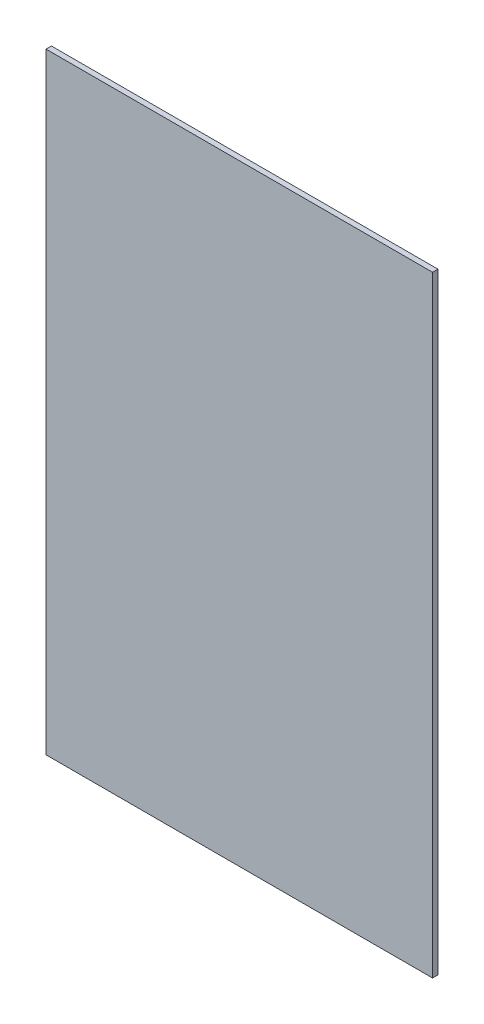
ISO-10303-21;
HEADER;
FILE_DESCRIPTION(('STEP AP214'),'2;1');
FILE_NAME('part.step','',(''),(''),'','','');
FILE_SCHEMA(('AUTOMOTIVE_DESIGN { 1 0 10303 214 1 1 1 1 }'));
ENDSEC;
DATA;
#1=APPLICATION_CONTEXT('core data for automotive mechanical design processes');
#2=APPLICATION_PROTOCOL_DEFINITION('international standard','automotive_design',2000,#1);
#3=PRODUCT_CONTEXT('',#1,'mechanical');
#4=PRODUCT('Part','Part','',(#3));
#5=PRODUCT_RELATED_PRODUCT_CATEGORY('part','',(#4));
#6=PRODUCT_DEFINITION_FORMATION('','',#4);
#7=PRODUCT_DEFINITION_CONTEXT('part definition',#1,'design');
#8=PRODUCT_DEFINITION('design','',#6,#7);
#9=PRODUCT_DEFINITION_SHAPE('','',#8);
#10=(LENGTH_UNIT() NAMED_UNIT(*) SI_UNIT(.MILLI.,.METRE.));
#11=(NAMED_UNIT(*) PLANE_ANGLE_UNIT() SI_UNIT($,.RADIAN.));
#12=(NAMED_UNIT(*) SI_UNIT($,.STERADIAN.) SOLID_ANGLE_UNIT());
#13=UNCERTAINTY_MEASURE_WITH_UNIT(LENGTH_MEASURE(1.E-05),#10,'distance_accuracy_value','');
#14=(GEOMETRIC_REPRESENTATION_CONTEXT(3) GLOBAL_UNCERTAINTY_ASSIGNED_CONTEXT((#13)) GLOBAL_UNIT_ASSIGNED_CONTEXT((#10,
#11,#12)) REPRESENTATION_CONTEXT('',''));
#15=CARTESIAN_POINT('',(0.,0.,0.));
#16=DIRECTION('',(0.,0.,1.));
#17=DIRECTION('',(1.,0.,0.));
#18=AXIS2_PLACEMENT_3D('',#15,#16,#17);
#19=CARTESIAN_POINT('',(107.5,330.,-125.5));
#20=DIRECTION('',(-1.,0.,0.));
#21=DIRECTION('',(0.,0.,1.));
#22=AXIS2_PLACEMENT_3D('',#19,#20,#21);
#23=PLANE('',#22);
#24=DIRECTION('',(0.,-1.,0.));
#25=VECTOR('',#24,1.);
#26=CARTESIAN_POINT('',(107.5,330.,-122.5));
#27=LINE('',#26,#25);
#28=CARTESIAN_POINT('',(107.5,330.,-122.5));
#29=VERTEX_POINT('',#28);
#30=CARTESIAN_POINT('',(107.5,-9.99999999999995,-122.5));
#31=VERTEX_POINT('',#30);
#32=EDGE_CURVE('E106',#29,#31,#27,.T.);
#33=ORIENTED_EDGE('',*,*,#32,.T.);
#34=DIRECTION('',(0.,0.,1.));
#35=VECTOR('',#34,1.);
#36=CARTESIAN_POINT('',(107.5,-9.99999999999995,-125.5));
#37=LINE('',#36,#35);
#38=CARTESIAN_POINT('',(107.5,-9.99999999999995,-125.5));
#39=VERTEX_POINT('',#38);
#40=EDGE_CURVE('E11',#39,#31,#37,.T.);
#41=ORIENTED_EDGE('',*,*,#40,.F.);
#42=DIRECTION('',(0.,-1.,0.));
#43=VECTOR('',#42,1.);
#44=CARTESIAN_POINT('',(107.5,330.,-125.5));
#45=LINE('',#44,#43);
#46=CARTESIAN_POINT('',(107.5,330.,-125.5));
#47=VERTEX_POINT('',#46);
#48=EDGE_CURVE('E92',#47,#39,#45,.T.);
#49=ORIENTED_EDGE('',*,*,#48,.F.);
#50=DIRECTION('',(0.,0.,1.));
#51=VECTOR('',#50,1.);
#52=CARTESIAN_POINT('',(107.5,330.,-125.5));
#53=LINE('',#52,#51);
#54=EDGE_CURVE('E102',#47,#29,#53,.T.);
#55=ORIENTED_EDGE('',*,*,#54,.T.);
#56=EDGE_LOOP('',(#33,#41,#49,#55));
#57=FACE_BOUND('',#56,.T.);
#58=ADVANCED_FACE('F41',(#57),#23,.F.);
#59=CARTESIAN_POINT('',(107.5,-9.99999999999995,-125.5));
#60=DIRECTION('',(0.,1.,0.));
#61=DIRECTION('',(0.,0.,1.));
#62=AXIS2_PLACEMENT_3D('',#59,#60,#61);
#63=PLANE('',#62);
#64=DIRECTION('',(-1.,0.,0.));
#65=VECTOR('',#64,1.);
#66=CARTESIAN_POINT('',(107.5,-9.99999999999995,-122.5));
#67=LINE('',#66,#65);
#68=CARTESIAN_POINT('',(-107.5,-9.99999999999995,-122.500000000002));
#69=VERTEX_POINT('',#68);
#70=EDGE_CURVE('E96',#31,#69,#67,.T.);
#71=ORIENTED_EDGE('',*,*,#70,.T.);
#72=DIRECTION('',(0.,0.,1.));
#73=VECTOR('',#72,1.);
#74=CARTESIAN_POINT('',(-107.5,-9.99999999999995,-125.500000000002));
#75=LINE('',#74,#73);
#76=CARTESIAN_POINT('',(-107.5,-9.99999999999995,-125.500000000002));
#77=VERTEX_POINT('',#76);
#78=EDGE_CURVE('E49',#77,#69,#75,.T.);
#79=ORIENTED_EDGE('',*,*,#78,.F.);
#80=DIRECTION('',(-1.,0.,0.));
#81=VECTOR('',#80,1.);
#82=CARTESIAN_POINT('',(107.5,-9.99999999999995,-125.5));
#83=LINE('',#82,#81);
#84=EDGE_CURVE('E87',#39,#77,#83,.T.);
#85=ORIENTED_EDGE('',*,*,#84,.F.);
#86=ORIENTED_EDGE('',*,*,#40,.T.);
#87=EDGE_LOOP('',(#71,#79,#85,#86));
#88=FACE_BOUND('',#87,.T.);
#89=ADVANCED_FACE('F95',(#88),#63,.F.);
#90=CARTESIAN_POINT('',(-107.5,330.,-125.500000000002));
#91=DIRECTION('',(1.,0.,0.));
#92=DIRECTION('',(0.,0.,-1.));
#93=AXIS2_PLACEMENT_3D('',#90,#91,#92);
#94=PLANE('',#93);
#95=DIRECTION('',(0.,1.,0.));
#96=VECTOR('',#95,1.);
#97=CARTESIAN_POINT('',(-107.5,330.,-122.500000000002));
#98=LINE('',#97,#96);
#99=CARTESIAN_POINT('',(-107.5,330.,-122.500000000002));
#100=VERTEX_POINT('',#99);
#101=EDGE_CURVE('E74',#69,#100,#98,.T.);
#102=ORIENTED_EDGE('',*,*,#101,.T.);
#103=DIRECTION('',(0.,0.,1.));
#104=VECTOR('',#103,1.);
#105=CARTESIAN_POINT('',(-107.5,330.,-125.500000000002));
#106=LINE('',#105,#104);
#107=CARTESIAN_POINT('',(-107.5,330.,-125.500000000002));
#108=VERTEX_POINT('',#107);
#109=EDGE_CURVE('E97',#108,#100,#106,.T.);
#110=ORIENTED_EDGE('',*,*,#109,.F.);
#111=DIRECTION('',(0.,1.,0.));
#112=VECTOR('',#111,1.);
#113=CARTESIAN_POINT('',(-107.5,330.,-125.500000000002));
#114=LINE('',#113,#112);
#115=EDGE_CURVE('E90',#77,#108,#114,.T.);
#116=ORIENTED_EDGE('',*,*,#115,.F.);
#117=ORIENTED_EDGE('',*,*,#78,.T.);
#118=EDGE_LOOP('',(#102,#110,#116,#117));
#119=FACE_BOUND('',#118,.T.);
#120=ADVANCED_FACE('F98',(#119),#94,.F.);
#121=CARTESIAN_POINT('',(107.5,330.,-125.5));
#122=DIRECTION('',(0.,-1.,0.));
#123=DIRECTION('',(0.,0.,-1.));
#124=AXIS2_PLACEMENT_3D('',#121,#122,#123);
#125=PLANE('',#124);
#126=DIRECTION('',(1.,0.,0.));
#127=VECTOR('',#126,1.);
#128=CARTESIAN_POINT('',(107.5,330.,-122.5));
#129=LINE('',#128,#127);
#130=EDGE_CURVE('E80',#100,#29,#129,.T.);
#131=ORIENTED_EDGE('',*,*,#130,.T.);
#132=ORIENTED_EDGE('',*,*,#54,.F.);
#133=DIRECTION('',(1.,0.,0.));
#134=VECTOR('',#133,1.);
#135=CARTESIAN_POINT('',(107.5,330.,-125.5));
#136=LINE('',#135,#134);
#137=EDGE_CURVE('E57',#108,#47,#136,.T.);
#138=ORIENTED_EDGE('',*,*,#137,.F.);
#139=ORIENTED_EDGE('',*,*,#109,.T.);
#140=EDGE_LOOP('',(#131,#132,#138,#139));
#141=FACE_BOUND('',#140,.T.);
#142=ADVANCED_FACE('F114',(#141),#125,.F.);
#143=CARTESIAN_POINT('',(1.29618147673363E-12,0.,-125.500000000001));
#144=DIRECTION('',(0.,0.,-1.));
#145=DIRECTION('',(-1.,0.,0.));
#146=AXIS2_PLACEMENT_3D('',#143,#144,#145);
#147=PLANE('',#146);
#148=ORIENTED_EDGE('',*,*,#48,.T.);
#149=ORIENTED_EDGE('',*,*,#84,.T.);
#150=ORIENTED_EDGE('',*,*,#115,.T.);
#151=ORIENTED_EDGE('',*,*,#137,.T.);
#152=EDGE_LOOP('',(#148,#149,#150,#151));
#153=FACE_BOUND('',#152,.T.);
#154=ADVANCED_FACE('F88',(#153),#147,.T.);
#155=CARTESIAN_POINT('',(1.26513786527054E-12,0.,-122.500000000001));
#156=DIRECTION('',(0.,0.,-1.));
#157=DIRECTION('',(-1.,0.,0.));
#158=AXIS2_PLACEMENT_3D('',#155,#156,#157);
#159=PLANE('',#158);
#160=ORIENTED_EDGE('',*,*,#32,.F.);
#161=ORIENTED_EDGE('',*,*,#130,.F.);
#162=ORIENTED_EDGE('',*,*,#101,.F.);
#163=ORIENTED_EDGE('',*,*,#70,.F.);
#164=EDGE_LOOP('',(#160,#161,#162,#163));
#165=FACE_BOUND('',#164,.T.);
#166=ADVANCED_FACE('F117',(#165),#159,.F.);
#167=CLOSED_SHELL('',(#58,#89,#120,#142,#154,#166));
#168=MANIFOLD_SOLID_BREP('B2',#167);
#169=ADVANCED_BREP_SHAPE_REPRESENTATION('',(#18,#168),#14);
#170=SHAPE_DEFINITION_REPRESENTATION(#9,#169);
ENDSEC;
END-ISO-10303-21;
